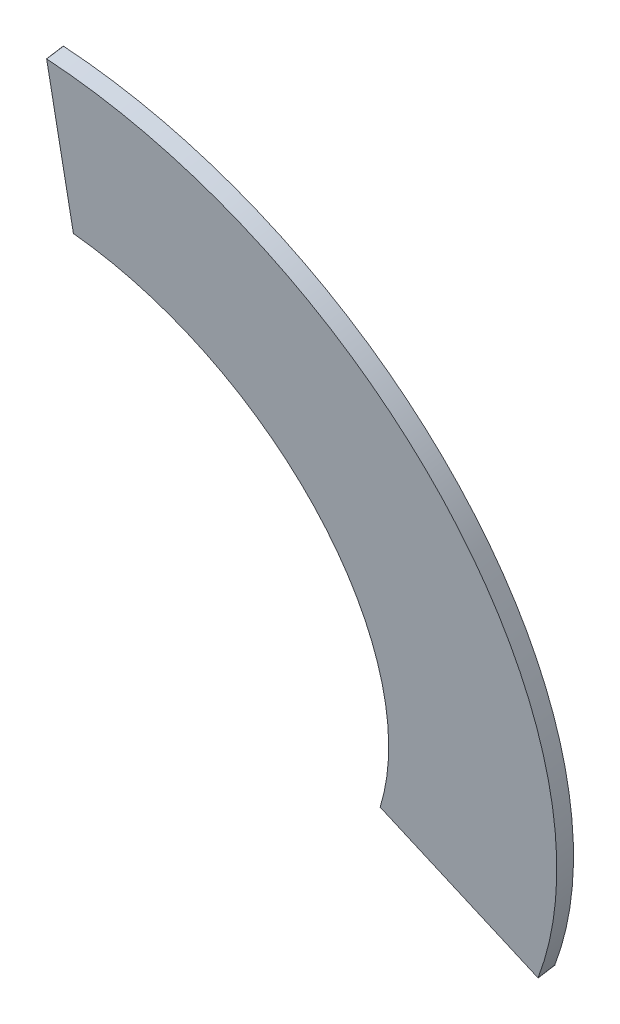
ISO-10303-21;
HEADER;
FILE_DESCRIPTION(('STEP AP214'),'2;1');
FILE_NAME('part.step','',(''),(''),'','','');
FILE_SCHEMA(('AUTOMOTIVE_DESIGN { 1 0 10303 214 1 1 1 1 }'));
ENDSEC;
DATA;
#1=APPLICATION_CONTEXT('core data for automotive mechanical design processes');
#2=APPLICATION_PROTOCOL_DEFINITION('international standard','automotive_design',2000,#1);
#3=PRODUCT_CONTEXT('',#1,'mechanical');
#4=PRODUCT('Part','Part','',(#3));
#5=PRODUCT_RELATED_PRODUCT_CATEGORY('part','',(#4));
#6=PRODUCT_DEFINITION_FORMATION('','',#4);
#7=PRODUCT_DEFINITION_CONTEXT('part definition',#1,'design');
#8=PRODUCT_DEFINITION('design','',#6,#7);
#9=PRODUCT_DEFINITION_SHAPE('','',#8);
#10=(LENGTH_UNIT() NAMED_UNIT(*) SI_UNIT(.MILLI.,.METRE.));
#11=(NAMED_UNIT(*) PLANE_ANGLE_UNIT() SI_UNIT($,.RADIAN.));
#12=(NAMED_UNIT(*) SI_UNIT($,.STERADIAN.) SOLID_ANGLE_UNIT());
#13=UNCERTAINTY_MEASURE_WITH_UNIT(LENGTH_MEASURE(1.E-05),#10,'distance_accuracy_value','');
#14=(GEOMETRIC_REPRESENTATION_CONTEXT(3) GLOBAL_UNCERTAINTY_ASSIGNED_CONTEXT((#13)) GLOBAL_UNIT_ASSIGNED_CONTEXT((#10,
#11,#12)) REPRESENTATION_CONTEXT('',''));
#15=CARTESIAN_POINT('',(0.,0.,0.));
#16=DIRECTION('',(0.,0.,1.));
#17=DIRECTION('',(1.,0.,0.));
#18=AXIS2_PLACEMENT_3D('',#15,#16,#17);
#19=CARTESIAN_POINT('',(-116.1986852462,24.0891496048619,32.5190625440246));
#20=DIRECTION('',(0.,0.160675602081711,-0.987007269930511));
#21=DIRECTION('',(0.,0.987007269930511,0.160675602081711));
#22=AXIS2_PLACEMENT_3D('',#19,#20,#21);
#23=CYLINDRICAL_SURFACE('',#22,20.3338559378478);
#24=CARTESIAN_POINT('',(-116.1986852462,24.2073990570913,31.7926730517586));
#25=DIRECTION('',(0.,0.160675602081711,-0.987007269930511));
#26=DIRECTION('',(0.0821009327635732,0.983675152928504,0.160133164430222));
#27=AXIS2_PLACEMENT_3D('',#24,#25,#26);
#28=CIRCLE('',#27,20.3338559378478);
#29=CARTESIAN_POINT('',(-114.529256707023,44.2093079063799,35.0487977481544));
#30=VERTEX_POINT('',#29);
#31=CARTESIAN_POINT('',(-97.813784959355,15.6334276899854,30.3969102710671));
#32=VERTEX_POINT('',#31);
#33=EDGE_CURVE('E112',#30,#32,#28,.T.);
#34=ORIENTED_EDGE('',*,*,#33,.F.);
#35=DIRECTION('',(0.,0.160675602081711,-0.987007269930511));
#36=VECTOR('',#35,1.);
#37=CARTESIAN_POINT('',(-114.529256707023,44.0910584541505,35.7751872404204));
#38=LINE('',#37,#36);
#39=CARTESIAN_POINT('',(-114.529256707023,44.0910584541505,35.7751872404204));
#40=VERTEX_POINT('',#39);
#41=EDGE_CURVE('E32',#40,#30,#38,.T.);
#42=ORIENTED_EDGE('',*,*,#41,.F.);
#43=CARTESIAN_POINT('',(-116.1986852462,24.0891496048619,32.5190625440246));
#44=DIRECTION('',(0.,0.160675602081711,-0.987007269930511));
#45=DIRECTION('',(0.0821009327635732,0.983675152928504,0.160133164430222));
#46=AXIS2_PLACEMENT_3D('',#43,#44,#45);
#47=CIRCLE('',#46,20.3338559378478);
#48=CARTESIAN_POINT('',(-97.813784959355,15.515178237756,31.1232997633331));
#49=VERTEX_POINT('',#48);
#50=EDGE_CURVE('E132',#40,#49,#47,.T.);
#51=ORIENTED_EDGE('',*,*,#50,.T.);
#52=DIRECTION('',(0.,0.160675602081711,-0.987007269930511));
#53=VECTOR('',#52,1.);
#54=CARTESIAN_POINT('',(-97.813784959355,15.515178237756,31.1232997633331));
#55=LINE('',#54,#53);
#56=EDGE_CURVE('E10',#49,#32,#55,.T.);
#57=ORIENTED_EDGE('',*,*,#56,.T.);
#58=EDGE_LOOP('',(#34,#42,#51,#57));
#59=FACE_BOUND('',#58,.T.);
#60=ADVANCED_FACE('F16',(#59),#23,.T.);
#61=CARTESIAN_POINT('',(-97.9649973065859,15.9780980046839,31.1986587951584));
#62=DIRECTION('',(0.951757426285897,0.302864594476866,0.049303538635769));
#63=DIRECTION('',(-0.303233374468972,0.952916324032787,0.));
#64=AXIS2_PLACEMENT_3D('',#61,#62,#63);
#65=PLANE('',#64);
#66=DIRECTION('',(0.306851432308284,-0.939391498954534,-0.152924197504214));
#67=VECTOR('',#66,1.);
#68=CARTESIAN_POINT('',(-97.9649973065859,16.0963474569133,30.4722693028924));
#69=LINE('',#68,#67);
#70=CARTESIAN_POINT('',(-97.8122825505289,15.6288282326239,30.3961615221942));
#71=VERTEX_POINT('',#70);
#72=EDGE_CURVE('E115',#32,#71,#69,.T.);
#73=ORIENTED_EDGE('',*,*,#72,.F.);
#74=ORIENTED_EDGE('',*,*,#56,.F.);
#75=DIRECTION('',(0.306851432308284,-0.939391498954534,-0.152924197504214));
#76=VECTOR('',#75,1.);
#77=CARTESIAN_POINT('',(-97.9649973065859,15.9780980046839,31.1986587951584));
#78=LINE('',#77,#76);
#79=CARTESIAN_POINT('',(-97.8122825505289,15.5105787803945,31.1225510144601));
#80=VERTEX_POINT('',#79);
#81=EDGE_CURVE('E141',#49,#80,#78,.T.);
#82=ORIENTED_EDGE('',*,*,#81,.T.);
#83=DIRECTION('',(0.,0.160675602081711,-0.987007269930511));
#84=VECTOR('',#83,1.);
#85=CARTESIAN_POINT('',(-97.8122825505289,15.5105787803945,31.1225510144601));
#86=LINE('',#85,#84);
#87=EDGE_CURVE('E24',#80,#71,#86,.T.);
#88=ORIENTED_EDGE('',*,*,#87,.T.);
#89=EDGE_LOOP('',(#73,#74,#82,#88));
#90=FACE_BOUND('',#89,.T.);
#91=ADVANCED_FACE('F140',(#90),#65,.T.);
#92=CARTESIAN_POINT('',(-97.8122825505289,15.5105787803945,31.1225510144601));
#93=DIRECTION('',(-0.5,-0.854773369479747,-0.139149153171122));
#94=DIRECTION('',(0.863170783338306,-0.504912070355953,0.));
#95=AXIS2_PLACEMENT_3D('',#92,#93,#94);
#96=PLANE('',#95);
#97=DIRECTION('',(-0.866025403784439,0.493503634965255,0.0803378010408555));
#98=VECTOR('',#97,1.);
#99=CARTESIAN_POINT('',(-97.8122825505289,15.6288282326239,30.3961615221942));
#100=LINE('',#99,#98);
#101=CARTESIAN_POINT('',(-104.095970300162,19.2095808662987,30.9790747416296));
#102=VERTEX_POINT('',#101);
#103=EDGE_CURVE('E118',#71,#102,#100,.T.);
#104=ORIENTED_EDGE('',*,*,#103,.F.);
#105=ORIENTED_EDGE('',*,*,#87,.F.);
#106=DIRECTION('',(-0.866025403784439,0.493503634965255,0.0803378010408555));
#107=VECTOR('',#106,1.);
#108=CARTESIAN_POINT('',(-97.8122825505289,15.5105787803945,31.1225510144601));
#109=LINE('',#108,#107);
#110=CARTESIAN_POINT('',(-104.095970300162,19.0913314140694,31.7054642338955));
#111=VERTEX_POINT('',#110);
#112=EDGE_CURVE('E150',#80,#111,#109,.T.);
#113=ORIENTED_EDGE('',*,*,#112,.T.);
#114=DIRECTION('',(0.,0.160675602081711,-0.987007269930511));
#115=VECTOR('',#114,1.);
#116=CARTESIAN_POINT('',(-104.095970300162,19.0913314140694,31.7054642338955));
#117=LINE('',#116,#115);
#118=EDGE_CURVE('E138',#111,#102,#117,.T.);
#119=ORIENTED_EDGE('',*,*,#118,.T.);
#120=EDGE_LOOP('',(#104,#105,#113,#119));
#121=FACE_BOUND('',#120,.T.);
#122=ADVANCED_FACE('F145',(#121),#96,.T.);
#123=CARTESIAN_POINT('',(-103.680140416231,19.2348660932776,31.7288303444643));
#124=DIRECTION('',(0.330115174788582,-0.931676294729986,-0.151668234025812));
#125=DIRECTION('',(0.942580577913487,0.333978822891928,0.));
#126=AXIS2_PLACEMENT_3D('',#123,#124,#125);
#127=PLANE('',#126);
#128=DIRECTION('',(-0.943940660939184,-0.325826077430712,-0.0530414544654619));
#129=VECTOR('',#128,1.);
#130=CARTESIAN_POINT('',(-103.680140416231,19.3531155455069,31.0024408521984));
#131=LINE('',#130,#129);
#132=CARTESIAN_POINT('',(-104.099968648872,19.2082007305228,30.9788500683638));
#133=VERTEX_POINT('',#132);
#134=EDGE_CURVE('E121',#102,#133,#131,.T.);
#135=ORIENTED_EDGE('',*,*,#134,.F.);
#136=ORIENTED_EDGE('',*,*,#118,.F.);
#137=DIRECTION('',(-0.943940660939184,-0.325826077430712,-0.0530414544654619));
#138=VECTOR('',#137,1.);
#139=CARTESIAN_POINT('',(-103.680140416231,19.2348660932776,31.7288303444643));
#140=LINE('',#139,#138);
#141=CARTESIAN_POINT('',(-104.099968648872,19.0899512782935,31.7052395606297));
#142=VERTEX_POINT('',#141);
#143=EDGE_CURVE('E154',#111,#142,#140,.T.);
#144=ORIENTED_EDGE('',*,*,#143,.T.);
#145=DIRECTION('',(0.,0.160675602081711,-0.987007269930511));
#146=VECTOR('',#145,1.);
#147=CARTESIAN_POINT('',(-104.099968648872,19.0899512782935,31.7052395606297));
#148=LINE('',#147,#146);
#149=EDGE_CURVE('E136',#142,#133,#148,.T.);
#150=ORIENTED_EDGE('',*,*,#149,.T.);
#151=EDGE_LOOP('',(#135,#136,#144,#150));
#152=FACE_BOUND('',#151,.T.);
#153=ADVANCED_FACE('F161',(#152),#127,.T.);
#154=CARTESIAN_POINT('',(-116.1986852462,24.089149604862,32.5190625440246));
#155=DIRECTION('',(0.,0.160675602081711,-0.987007269930511));
#156=DIRECTION('',(0.,0.987007269930511,0.160675602081711));
#157=AXIS2_PLACEMENT_3D('',#154,#155,#156);
#158=CYLINDRICAL_SURFACE('',#157,13.1161440621522);
#159=CARTESIAN_POINT('',(-116.1986852462,24.2073990570914,31.7926730517586));
#160=DIRECTION('',(0.,-0.160675602081711,0.987007269930511));
#161=DIRECTION('',(0.922429377109393,-0.381148476479012,-0.06204742640356));
#162=AXIS2_PLACEMENT_3D('',#159,#160,#161);
#163=CIRCLE('',#162,13.1161440621522);
#164=CARTESIAN_POINT('',(-114.535751324805,37.0486589726543,33.8831107124317));
#165=VERTEX_POINT('',#164);
#166=EDGE_CURVE('E124',#133,#165,#163,.T.);
#167=ORIENTED_EDGE('',*,*,#166,.F.);
#168=ORIENTED_EDGE('',*,*,#149,.F.);
#169=CARTESIAN_POINT('',(-116.1986852462,24.089149604862,32.5190625440246));
#170=DIRECTION('',(0.,-0.160675602081711,0.987007269930511));
#171=DIRECTION('',(0.922429377109393,-0.381148476479012,-0.06204742640356));
#172=AXIS2_PLACEMENT_3D('',#169,#170,#171);
#173=CIRCLE('',#172,13.1161440621522);
#174=CARTESIAN_POINT('',(-114.535751324805,36.930409520425,34.6095002046976));
#175=VERTEX_POINT('',#174);
#176=EDGE_CURVE('E103',#142,#175,#173,.T.);
#177=ORIENTED_EDGE('',*,*,#176,.T.);
#178=DIRECTION('',(0.,0.160675602081711,-0.987007269930511));
#179=VECTOR('',#178,1.);
#180=CARTESIAN_POINT('',(-114.535751324805,36.930409520425,34.6095002046976));
#181=LINE('',#180,#179);
#182=EDGE_CURVE('E95',#175,#165,#181,.T.);
#183=ORIENTED_EDGE('',*,*,#182,.T.);
#184=EDGE_LOOP('',(#167,#168,#177,#183));
#185=FACE_BOUND('',#184,.T.);
#186=ADVANCED_FACE('F158',(#185),#158,.F.);
#187=CARTESIAN_POINT('',(-114.1986852462,37.2168101059499,34.6561235558296));
#188=DIRECTION('',(-0.652419004644114,0.748011807635426,0.121769364033674));
#189=DIRECTION('',(-0.753619928776209,-0.65731043119012,0.));
#190=AXIS2_PLACEMENT_3D('',#187,#188,#189);
#191=PLANE('',#190);
#192=DIRECTION('',(0.757858458011246,0.643942300624567,0.104827816380752));
#193=VECTOR('',#192,1.);
#194=CARTESIAN_POINT('',(-114.1986852462,37.3350595581793,33.9297340635636));
#195=LINE('',#194,#193);
#196=CARTESIAN_POINT('',(-114.532541184048,37.0513865867658,33.8835547426359));
#197=VERTEX_POINT('',#196);
#198=EDGE_CURVE('E127',#165,#197,#195,.T.);
#199=ORIENTED_EDGE('',*,*,#198,.F.);
#200=ORIENTED_EDGE('',*,*,#182,.F.);
#201=DIRECTION('',(0.757858458011246,0.643942300624567,0.104827816380752));
#202=VECTOR('',#201,1.);
#203=CARTESIAN_POINT('',(-114.1986852462,37.2168101059499,34.6561235558296));
#204=LINE('',#203,#202);
#205=CARTESIAN_POINT('',(-114.532541184048,36.9331371345365,34.6099442349018));
#206=VERTEX_POINT('',#205);
#207=EDGE_CURVE('E98',#175,#206,#204,.T.);
#208=ORIENTED_EDGE('',*,*,#207,.T.);
#209=DIRECTION('',(0.,0.160675602081711,-0.987007269930511));
#210=VECTOR('',#209,1.);
#211=CARTESIAN_POINT('',(-114.532541184048,36.9331371345365,34.6099442349018));
#212=LINE('',#211,#210);
#213=EDGE_CURVE('E84',#206,#197,#212,.T.);
#214=ORIENTED_EDGE('',*,*,#213,.T.);
#215=EDGE_LOOP('',(#199,#200,#208,#214));
#216=FACE_BOUND('',#215,.T.);
#217=ADVANCED_FACE('F99',(#216),#191,.T.);
#218=CARTESIAN_POINT('',(-114.532541184048,36.9331371345365,34.6099442349018));
#219=DIRECTION('',(-1.,0.,0.));
#220=DIRECTION('',(0.,0.,1.));
#221=AXIS2_PLACEMENT_3D('',#218,#219,#220);
#222=PLANE('',#221);
#223=DIRECTION('',(0.,0.98700726993051,0.160675602081711));
#224=VECTOR('',#223,1.);
#225=CARTESIAN_POINT('',(-114.532541184048,37.0513865867658,33.8835547426359));
#226=LINE('',#225,#224);
#227=CARTESIAN_POINT('',(-114.532541184048,44.2128918541153,35.0493811815067));
#228=VERTEX_POINT('',#227);
#229=EDGE_CURVE('E91',#197,#228,#226,.T.);
#230=ORIENTED_EDGE('',*,*,#229,.F.);
#231=ORIENTED_EDGE('',*,*,#213,.F.);
#232=DIRECTION('',(0.,0.98700726993051,0.160675602081711));
#233=VECTOR('',#232,1.);
#234=CARTESIAN_POINT('',(-114.532541184048,36.9331371345365,34.6099442349018));
#235=LINE('',#234,#233);
#236=CARTESIAN_POINT('',(-114.532541184048,44.0946424018859,35.7757706737727));
#237=VERTEX_POINT('',#236);
#238=EDGE_CURVE('E88',#206,#237,#235,.T.);
#239=ORIENTED_EDGE('',*,*,#238,.T.);
#240=DIRECTION('',(0.,0.160675602081711,-0.987007269930511));
#241=VECTOR('',#240,1.);
#242=CARTESIAN_POINT('',(-114.532541184048,44.0946424018859,35.7757706737727));
#243=LINE('',#242,#241);
#244=EDGE_CURVE('E60',#237,#228,#243,.T.);
#245=ORIENTED_EDGE('',*,*,#244,.T.);
#246=EDGE_LOOP('',(#230,#231,#239,#245));
#247=FACE_BOUND('',#246,.T.);
#248=ADVANCED_FACE('F86',(#247),#222,.T.);
#249=CARTESIAN_POINT('',(-114.532541184048,44.0946424018859,35.7757706737727));
#250=DIRECTION('',(0.741619848709569,0.662104604955329,0.107784470574123));
#251=DIRECTION('',(-0.665984440854612,0.745965632277768,0.));
#252=AXIS2_PLACEMENT_3D('',#249,#250,#251);
#253=PLANE('',#252);
#254=DIRECTION('',(0.670820393249934,-0.731984182201108,-0.119160215707167));
#255=VECTOR('',#254,1.);
#256=CARTESIAN_POINT('',(-114.532541184048,44.2128918541153,35.0493811815067));
#257=LINE('',#256,#255);
#258=EDGE_CURVE('E130',#228,#30,#257,.T.);
#259=ORIENTED_EDGE('',*,*,#258,.F.);
#260=ORIENTED_EDGE('',*,*,#244,.F.);
#261=DIRECTION('',(0.670820393249934,-0.731984182201108,-0.119160215707167));
#262=VECTOR('',#261,1.);
#263=CARTESIAN_POINT('',(-114.532541184048,44.0946424018859,35.7757706737727));
#264=LINE('',#263,#262);
#265=EDGE_CURVE('E107',#237,#40,#264,.T.);
#266=ORIENTED_EDGE('',*,*,#265,.T.);
#267=ORIENTED_EDGE('',*,*,#41,.T.);
#268=EDGE_LOOP('',(#259,#260,#266,#267));
#269=FACE_BOUND('',#268,.T.);
#270=ADVANCED_FACE('F213',(#269),#253,.T.);
#271=CARTESIAN_POINT('',(-116.1986852462,-0.868410127831424,28.4562039828884));
#272=DIRECTION('',(0.,0.160675602081711,-0.98700726993051));
#273=DIRECTION('',(-1.,0.,0.));
#274=AXIS2_PLACEMENT_3D('',#271,#272,#273);
#275=PLANE('',#274);
#276=ORIENTED_EDGE('',*,*,#50,.F.);
#277=ORIENTED_EDGE('',*,*,#265,.F.);
#278=ORIENTED_EDGE('',*,*,#238,.F.);
#279=ORIENTED_EDGE('',*,*,#207,.F.);
#280=ORIENTED_EDGE('',*,*,#176,.F.);
#281=ORIENTED_EDGE('',*,*,#143,.F.);
#282=ORIENTED_EDGE('',*,*,#112,.F.);
#283=ORIENTED_EDGE('',*,*,#81,.F.);
#284=EDGE_LOOP('',(#276,#277,#278,#279,#280,#281,#282,#283));
#285=FACE_BOUND('',#284,.T.);
#286=ADVANCED_FACE('F106',(#285),#275,.F.);
#287=CARTESIAN_POINT('',(-116.1986852462,-0.750160675602082,27.7298144906225));
#288=DIRECTION('',(0.,0.160675602081711,-0.98700726993051));
#289=DIRECTION('',(-1.,0.,0.));
#290=AXIS2_PLACEMENT_3D('',#287,#288,#289);
#291=PLANE('',#290);
#292=ORIENTED_EDGE('',*,*,#33,.T.);
#293=ORIENTED_EDGE('',*,*,#72,.T.);
#294=ORIENTED_EDGE('',*,*,#103,.T.);
#295=ORIENTED_EDGE('',*,*,#134,.T.);
#296=ORIENTED_EDGE('',*,*,#166,.T.);
#297=ORIENTED_EDGE('',*,*,#198,.T.);
#298=ORIENTED_EDGE('',*,*,#229,.T.);
#299=ORIENTED_EDGE('',*,*,#258,.T.);
#300=EDGE_LOOP('',(#292,#293,#294,#295,#296,#297,#298,#299));
#301=FACE_BOUND('',#300,.T.);
#302=ADVANCED_FACE('F148',(#301),#291,.T.);
#303=CLOSED_SHELL('',(#60,#91,#122,#153,#186,#217,#248,#270,#286,#302));
#304=MANIFOLD_SOLID_BREP('B1',#303);
#305=ADVANCED_BREP_SHAPE_REPRESENTATION('',(#18,#304),#14);
#306=SHAPE_DEFINITION_REPRESENTATION(#9,#305);
ENDSEC;
END-ISO-10303-21;
